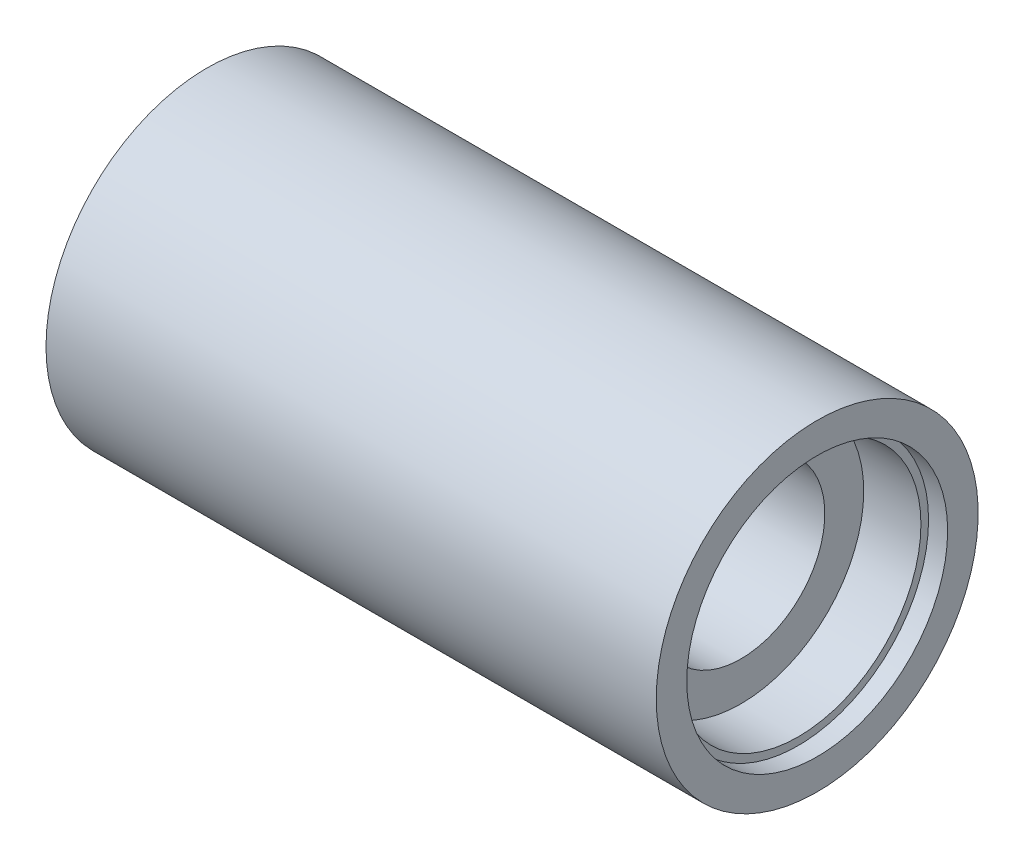
ISO-10303-21;
HEADER;
FILE_DESCRIPTION(('STEP AP214'),'2;1');
FILE_NAME('part.step','',(''),(''),'','','');
FILE_SCHEMA(('AUTOMOTIVE_DESIGN { 1 0 10303 214 1 1 1 1 }'));
ENDSEC;
DATA;
#1=APPLICATION_CONTEXT('core data for automotive mechanical design processes');
#2=APPLICATION_PROTOCOL_DEFINITION('international standard','automotive_design',2000,#1);
#3=PRODUCT_CONTEXT('',#1,'mechanical');
#4=PRODUCT('Part','Part','',(#3));
#5=PRODUCT_RELATED_PRODUCT_CATEGORY('part','',(#4));
#6=PRODUCT_DEFINITION_FORMATION('','',#4);
#7=PRODUCT_DEFINITION_CONTEXT('part definition',#1,'design');
#8=PRODUCT_DEFINITION('design','',#6,#7);
#9=PRODUCT_DEFINITION_SHAPE('','',#8);
#10=(LENGTH_UNIT() NAMED_UNIT(*) SI_UNIT(.MILLI.,.METRE.));
#11=(NAMED_UNIT(*) PLANE_ANGLE_UNIT() SI_UNIT($,.RADIAN.));
#12=(NAMED_UNIT(*) SI_UNIT($,.STERADIAN.) SOLID_ANGLE_UNIT());
#13=UNCERTAINTY_MEASURE_WITH_UNIT(LENGTH_MEASURE(1.E-05),#10,'distance_accuracy_value','');
#14=(GEOMETRIC_REPRESENTATION_CONTEXT(3) GLOBAL_UNCERTAINTY_ASSIGNED_CONTEXT((#13)) GLOBAL_UNIT_ASSIGNED_CONTEXT((#10,
#11,#12)) REPRESENTATION_CONTEXT('',''));
#15=CARTESIAN_POINT('',(0.,0.,0.));
#16=DIRECTION('',(0.,0.,1.));
#17=DIRECTION('',(1.,0.,0.));
#18=AXIS2_PLACEMENT_3D('',#15,#16,#17);
#19=CARTESIAN_POINT('',(0.,0.,0.));
#20=DIRECTION('',(-1.,0.,0.));
#21=DIRECTION('',(0.,0.,1.));
#22=AXIS2_PLACEMENT_3D('',#19,#20,#21);
#23=CYLINDRICAL_SURFACE('',#22,21.1);
#24=CARTESIAN_POINT('',(40.,0.,0.));
#25=DIRECTION('',(-1.,0.,0.));
#26=DIRECTION('',(0.,0.,1.));
#27=AXIS2_PLACEMENT_3D('',#24,#25,#26);
#28=CIRCLE('',#27,21.1);
#29=CARTESIAN_POINT('',(40.,0.,21.1));
#30=VERTEX_POINT('',#29);
#31=EDGE_CURVE('E10',#30,#30,#28,.T.);
#32=ORIENTED_EDGE('',*,*,#31,.T.);
#33=EDGE_LOOP('',(#32));
#34=FACE_BOUND('',#33,.T.);
#35=CARTESIAN_POINT('',(-40.,0.,0.));
#36=DIRECTION('',(-1.,0.,0.));
#37=DIRECTION('',(0.,0.,1.));
#38=AXIS2_PLACEMENT_3D('',#35,#36,#37);
#39=CIRCLE('',#38,21.1);
#40=CARTESIAN_POINT('',(-40.,0.,21.1));
#41=VERTEX_POINT('',#40);
#42=EDGE_CURVE('E72',#41,#41,#39,.T.);
#43=ORIENTED_EDGE('',*,*,#42,.F.);
#44=EDGE_LOOP('',(#43));
#45=FACE_BOUND('',#44,.T.);
#46=ADVANCED_FACE('F41',(#34,#45),#23,.T.);
#47=CARTESIAN_POINT('',(40.,21.1,0.));
#48=DIRECTION('',(-1.,0.,0.));
#49=DIRECTION('',(0.,0.,1.));
#50=AXIS2_PLACEMENT_3D('',#47,#48,#49);
#51=PLANE('',#50);
#52=ORIENTED_EDGE('',*,*,#31,.F.);
#53=EDGE_LOOP('',(#52));
#54=FACE_BOUND('',#53,.T.);
#55=CARTESIAN_POINT('',(40.,0.,0.));
#56=DIRECTION('',(-1.,0.,0.));
#57=DIRECTION('',(0.,0.,1.));
#58=AXIS2_PLACEMENT_3D('',#55,#56,#57);
#59=CIRCLE('',#58,17.1);
#60=CARTESIAN_POINT('',(40.,0.,17.1));
#61=VERTEX_POINT('',#60);
#62=EDGE_CURVE('E48',#61,#61,#59,.T.);
#63=ORIENTED_EDGE('',*,*,#62,.T.);
#64=EDGE_LOOP('',(#63));
#65=FACE_BOUND('',#64,.T.);
#66=ADVANCED_FACE('F111',(#54,#65),#51,.F.);
#67=CARTESIAN_POINT('',(0.,0.,0.));
#68=DIRECTION('',(-1.,0.,0.));
#69=DIRECTION('',(0.,0.,1.));
#70=AXIS2_PLACEMENT_3D('',#67,#68,#69);
#71=CYLINDRICAL_SURFACE('',#70,17.1);
#72=ORIENTED_EDGE('',*,*,#62,.F.);
#73=EDGE_LOOP('',(#72));
#74=FACE_BOUND('',#73,.T.);
#75=CARTESIAN_POINT('',(37.5,0.,0.));
#76=DIRECTION('',(-1.,0.,0.));
#77=DIRECTION('',(0.,0.,1.));
#78=AXIS2_PLACEMENT_3D('',#75,#76,#77);
#79=CIRCLE('',#78,17.1);
#80=CARTESIAN_POINT('',(37.5,0.,17.1));
#81=VERTEX_POINT('',#80);
#82=EDGE_CURVE('E53',#81,#81,#79,.T.);
#83=ORIENTED_EDGE('',*,*,#82,.T.);
#84=EDGE_LOOP('',(#83));
#85=FACE_BOUND('',#84,.T.);
#86=ADVANCED_FACE('F115',(#74,#85),#71,.F.);
#87=CARTESIAN_POINT('',(37.5,17.1,0.));
#88=DIRECTION('',(-1.,0.,0.));
#89=DIRECTION('',(0.,0.,1.));
#90=AXIS2_PLACEMENT_3D('',#87,#88,#89);
#91=PLANE('',#90);
#92=ORIENTED_EDGE('',*,*,#82,.F.);
#93=EDGE_LOOP('',(#92));
#94=FACE_BOUND('',#93,.T.);
#95=CARTESIAN_POINT('',(37.5,0.,0.));
#96=DIRECTION('',(-1.,0.,0.));
#97=DIRECTION('',(0.,0.,1.));
#98=AXIS2_PLACEMENT_3D('',#95,#96,#97);
#99=CIRCLE('',#98,16.1);
#100=CARTESIAN_POINT('',(37.5,0.,16.1));
#101=VERTEX_POINT('',#100);
#102=EDGE_CURVE('E58',#101,#101,#99,.T.);
#103=ORIENTED_EDGE('',*,*,#102,.T.);
#104=EDGE_LOOP('',(#103));
#105=FACE_BOUND('',#104,.T.);
#106=ADVANCED_FACE('F151',(#94,#105),#91,.F.);
#107=CARTESIAN_POINT('',(0.,0.,0.));
#108=DIRECTION('',(-1.,0.,0.));
#109=DIRECTION('',(0.,0.,1.));
#110=AXIS2_PLACEMENT_3D('',#107,#108,#109);
#111=CYLINDRICAL_SURFACE('',#110,16.1);
#112=ORIENTED_EDGE('',*,*,#102,.F.);
#113=EDGE_LOOP('',(#112));
#114=FACE_BOUND('',#113,.T.);
#115=CARTESIAN_POINT('',(30.,0.,0.));
#116=DIRECTION('',(-1.,0.,0.));
#117=DIRECTION('',(0.,0.,1.));
#118=AXIS2_PLACEMENT_3D('',#115,#116,#117);
#119=CIRCLE('',#118,16.1);
#120=CARTESIAN_POINT('',(30.,0.,16.1));
#121=VERTEX_POINT('',#120);
#122=EDGE_CURVE('E64',#121,#121,#119,.T.);
#123=ORIENTED_EDGE('',*,*,#122,.T.);
#124=EDGE_LOOP('',(#123));
#125=FACE_BOUND('',#124,.T.);
#126=ADVANCED_FACE('F147',(#114,#125),#111,.F.);
#127=CARTESIAN_POINT('',(30.,16.1,0.));
#128=DIRECTION('',(-1.,0.,0.));
#129=DIRECTION('',(0.,0.,1.));
#130=AXIS2_PLACEMENT_3D('',#127,#128,#129);
#131=PLANE('',#130);
#132=ORIENTED_EDGE('',*,*,#122,.F.);
#133=EDGE_LOOP('',(#132));
#134=FACE_BOUND('',#133,.T.);
#135=CARTESIAN_POINT('',(30.,0.,0.));
#136=DIRECTION('',(-1.,0.,0.));
#137=DIRECTION('',(0.,0.,1.));
#138=AXIS2_PLACEMENT_3D('',#135,#136,#137);
#139=CIRCLE('',#138,11.);
#140=CARTESIAN_POINT('',(30.,0.,11.));
#141=VERTEX_POINT('',#140);
#142=EDGE_CURVE('E68',#141,#141,#139,.T.);
#143=ORIENTED_EDGE('',*,*,#142,.T.);
#144=EDGE_LOOP('',(#143));
#145=FACE_BOUND('',#144,.T.);
#146=ADVANCED_FACE('F143',(#134,#145),#131,.F.);
#147=CARTESIAN_POINT('',(0.,0.,0.));
#148=DIRECTION('',(-1.,0.,0.));
#149=DIRECTION('',(0.,0.,1.));
#150=AXIS2_PLACEMENT_3D('',#147,#148,#149);
#151=CYLINDRICAL_SURFACE('',#150,11.);
#152=ORIENTED_EDGE('',*,*,#142,.F.);
#153=EDGE_LOOP('',(#152));
#154=FACE_BOUND('',#153,.T.);
#155=CARTESIAN_POINT('',(-30.,0.,0.));
#156=DIRECTION('',(-1.,0.,0.));
#157=DIRECTION('',(0.,0.,1.));
#158=AXIS2_PLACEMENT_3D('',#155,#156,#157);
#159=CIRCLE('',#158,11.);
#160=CARTESIAN_POINT('',(-30.,0.,11.));
#161=VERTEX_POINT('',#160);
#162=EDGE_CURVE('E92',#161,#161,#159,.T.);
#163=ORIENTED_EDGE('',*,*,#162,.T.);
#164=EDGE_LOOP('',(#163));
#165=FACE_BOUND('',#164,.T.);
#166=ADVANCED_FACE('F97',(#154,#165),#151,.F.);
#167=CARTESIAN_POINT('',(-40.,21.1,0.));
#168=DIRECTION('',(1.,0.,0.));
#169=DIRECTION('',(0.,0.,1.));
#170=AXIS2_PLACEMENT_3D('',#167,#168,#169);
#171=PLANE('',#170);
#172=ORIENTED_EDGE('',*,*,#42,.T.);
#173=EDGE_LOOP('',(#172));
#174=FACE_BOUND('',#173,.T.);
#175=CARTESIAN_POINT('',(-40.,0.,0.));
#176=DIRECTION('',(-1.,0.,0.));
#177=DIRECTION('',(0.,0.,1.));
#178=AXIS2_PLACEMENT_3D('',#175,#176,#177);
#179=CIRCLE('',#178,17.1);
#180=CARTESIAN_POINT('',(-40.,0.,17.1));
#181=VERTEX_POINT('',#180);
#182=EDGE_CURVE('E76',#181,#181,#179,.T.);
#183=ORIENTED_EDGE('',*,*,#182,.F.);
#184=EDGE_LOOP('',(#183));
#185=FACE_BOUND('',#184,.T.);
#186=ADVANCED_FACE('F120',(#174,#185),#171,.F.);
#187=CARTESIAN_POINT('',(0.,0.,0.));
#188=DIRECTION('',(1.,0.,0.));
#189=DIRECTION('',(0.,0.,1.));
#190=AXIS2_PLACEMENT_3D('',#187,#188,#189);
#191=CYLINDRICAL_SURFACE('',#190,17.1);
#192=ORIENTED_EDGE('',*,*,#182,.T.);
#193=EDGE_LOOP('',(#192));
#194=FACE_BOUND('',#193,.T.);
#195=CARTESIAN_POINT('',(-37.5,0.,0.));
#196=DIRECTION('',(-1.,0.,0.));
#197=DIRECTION('',(0.,0.,1.));
#198=AXIS2_PLACEMENT_3D('',#195,#196,#197);
#199=CIRCLE('',#198,17.1);
#200=CARTESIAN_POINT('',(-37.5,0.,17.1));
#201=VERTEX_POINT('',#200);
#202=EDGE_CURVE('E80',#201,#201,#199,.T.);
#203=ORIENTED_EDGE('',*,*,#202,.F.);
#204=EDGE_LOOP('',(#203));
#205=FACE_BOUND('',#204,.T.);
#206=ADVANCED_FACE('F123',(#194,#205),#191,.F.);
#207=CARTESIAN_POINT('',(-37.5,17.1,0.));
#208=DIRECTION('',(1.,0.,0.));
#209=DIRECTION('',(0.,0.,1.));
#210=AXIS2_PLACEMENT_3D('',#207,#208,#209);
#211=PLANE('',#210);
#212=ORIENTED_EDGE('',*,*,#202,.T.);
#213=EDGE_LOOP('',(#212));
#214=FACE_BOUND('',#213,.T.);
#215=CARTESIAN_POINT('',(-37.5,0.,0.));
#216=DIRECTION('',(-1.,0.,0.));
#217=DIRECTION('',(0.,0.,1.));
#218=AXIS2_PLACEMENT_3D('',#215,#216,#217);
#219=CIRCLE('',#218,16.1);
#220=CARTESIAN_POINT('',(-37.5,0.,16.1));
#221=VERTEX_POINT('',#220);
#222=EDGE_CURVE('E84',#221,#221,#219,.T.);
#223=ORIENTED_EDGE('',*,*,#222,.F.);
#224=EDGE_LOOP('',(#223));
#225=FACE_BOUND('',#224,.T.);
#226=ADVANCED_FACE('F107',(#214,#225),#211,.F.);
#227=CARTESIAN_POINT('',(0.,0.,0.));
#228=DIRECTION('',(1.,0.,0.));
#229=DIRECTION('',(0.,0.,1.));
#230=AXIS2_PLACEMENT_3D('',#227,#228,#229);
#231=CYLINDRICAL_SURFACE('',#230,16.1);
#232=ORIENTED_EDGE('',*,*,#222,.T.);
#233=EDGE_LOOP('',(#232));
#234=FACE_BOUND('',#233,.T.);
#235=CARTESIAN_POINT('',(-30.,0.,0.));
#236=DIRECTION('',(-1.,0.,0.));
#237=DIRECTION('',(0.,0.,1.));
#238=AXIS2_PLACEMENT_3D('',#235,#236,#237);
#239=CIRCLE('',#238,16.1);
#240=CARTESIAN_POINT('',(-30.,0.,16.1));
#241=VERTEX_POINT('',#240);
#242=EDGE_CURVE('E88',#241,#241,#239,.T.);
#243=ORIENTED_EDGE('',*,*,#242,.F.);
#244=EDGE_LOOP('',(#243));
#245=FACE_BOUND('',#244,.T.);
#246=ADVANCED_FACE('F101',(#234,#245),#231,.F.);
#247=CARTESIAN_POINT('',(-30.,16.1,0.));
#248=DIRECTION('',(1.,0.,0.));
#249=DIRECTION('',(0.,0.,1.));
#250=AXIS2_PLACEMENT_3D('',#247,#248,#249);
#251=PLANE('',#250);
#252=ORIENTED_EDGE('',*,*,#242,.T.);
#253=EDGE_LOOP('',(#252));
#254=FACE_BOUND('',#253,.T.);
#255=ORIENTED_EDGE('',*,*,#162,.F.);
#256=EDGE_LOOP('',(#255));
#257=FACE_BOUND('',#256,.T.);
#258=ADVANCED_FACE('F99',(#254,#257),#251,.F.);
#259=CLOSED_SHELL('',(#46,#66,#86,#106,#126,#146,#166,#186,#206,#226,#246,#258));
#260=MANIFOLD_SOLID_BREP('B2',#259);
#261=ADVANCED_BREP_SHAPE_REPRESENTATION('',(#18,#260),#14);
#262=SHAPE_DEFINITION_REPRESENTATION(#9,#261);
ENDSEC;
END-ISO-10303-21;
